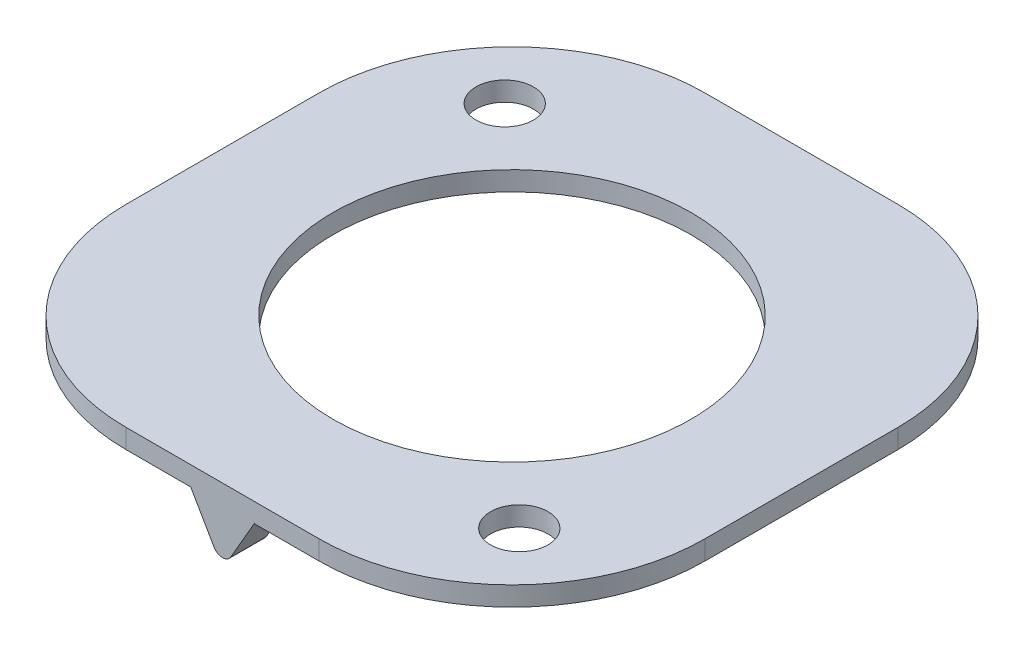
ISO-10303-21;
HEADER;
FILE_DESCRIPTION(('STEP AP214'),'2;1');
FILE_NAME('part.step','',(''),(''),'','','');
FILE_SCHEMA(('AUTOMOTIVE_DESIGN { 1 0 10303 214 1 1 1 1 }'));
ENDSEC;
DATA;
#1=APPLICATION_CONTEXT('core data for automotive mechanical design processes');
#2=APPLICATION_PROTOCOL_DEFINITION('international standard','automotive_design',2000,#1);
#3=PRODUCT_CONTEXT('',#1,'mechanical');
#4=PRODUCT('Part','Part','',(#3));
#5=PRODUCT_RELATED_PRODUCT_CATEGORY('part','',(#4));
#6=PRODUCT_DEFINITION_FORMATION('','',#4);
#7=PRODUCT_DEFINITION_CONTEXT('part definition',#1,'design');
#8=PRODUCT_DEFINITION('design','',#6,#7);
#9=PRODUCT_DEFINITION_SHAPE('','',#8);
#10=(LENGTH_UNIT() NAMED_UNIT(*) SI_UNIT(.MILLI.,.METRE.));
#11=(NAMED_UNIT(*) PLANE_ANGLE_UNIT() SI_UNIT($,.RADIAN.));
#12=(NAMED_UNIT(*) SI_UNIT($,.STERADIAN.) SOLID_ANGLE_UNIT());
#13=UNCERTAINTY_MEASURE_WITH_UNIT(LENGTH_MEASURE(1.E-05),#10,'distance_accuracy_value','');
#14=(GEOMETRIC_REPRESENTATION_CONTEXT(3) GLOBAL_UNCERTAINTY_ASSIGNED_CONTEXT((#13)) GLOBAL_UNIT_ASSIGNED_CONTEXT((#10,
#11,#12)) REPRESENTATION_CONTEXT('',''));
#15=CARTESIAN_POINT('',(0.,0.,0.));
#16=DIRECTION('',(0.,0.,1.));
#17=DIRECTION('',(1.,0.,0.));
#18=AXIS2_PLACEMENT_3D('',#15,#16,#17);
#19=CARTESIAN_POINT('',(-15.,19.,-15.01));
#20=DIRECTION('',(0.,-1.,0.));
#21=DIRECTION('',(0.,0.,-1.));
#22=AXIS2_PLACEMENT_3D('',#19,#20,#21);
#23=PLANE('',#22);
#24=CARTESIAN_POINT('',(0.,19.,0.));
#25=DIRECTION('',(0.,-1.,0.));
#26=DIRECTION('',(0.,0.,-1.));
#27=AXIS2_PLACEMENT_3D('',#24,#25,#26);
#28=CIRCLE('',#27,9.27774999999996);
#29=CARTESIAN_POINT('',(0.,19.,-9.27774999999995));
#30=VERTEX_POINT('',#29);
#31=EDGE_CURVE('E245',#30,#30,#28,.F.);
#32=ORIENTED_EDGE('',*,*,#31,.T.);
#33=EDGE_LOOP('',(#32));
#34=FACE_BOUND('',#33,.T.);
#35=CARTESIAN_POINT('',(9.71815906597584,19.,9.34105517720241));
#36=DIRECTION('',(0.,-1.,0.));
#37=DIRECTION('',(0.,0.,-1.));
#38=AXIS2_PLACEMENT_3D('',#35,#36,#37);
#39=CIRCLE('',#38,1.49);
#40=CARTESIAN_POINT('',(9.71815906597584,19.,7.85105517720241));
#41=VERTEX_POINT('',#40);
#42=EDGE_CURVE('E193',#41,#41,#39,.F.);
#43=ORIENTED_EDGE('',*,*,#42,.T.);
#44=EDGE_LOOP('',(#43));
#45=FACE_BOUND('',#44,.T.);
#46=CARTESIAN_POINT('',(-9.71815906597584,19.,-9.34105517720241));
#47=DIRECTION('',(0.,-1.,0.));
#48=DIRECTION('',(0.,0.,-1.));
#49=AXIS2_PLACEMENT_3D('',#46,#47,#48);
#50=CIRCLE('',#49,1.49);
#51=CARTESIAN_POINT('',(-9.71815906597584,19.,-10.8310551772024));
#52=VERTEX_POINT('',#51);
#53=EDGE_CURVE('E248',#52,#52,#50,.F.);
#54=ORIENTED_EDGE('',*,*,#53,.T.);
#55=EDGE_LOOP('',(#54));
#56=FACE_BOUND('',#55,.T.);
#57=DIRECTION('',(-1.,0.,0.));
#58=VECTOR('',#57,1.);
#59=CARTESIAN_POINT('',(15.,19.,15.));
#60=LINE('',#59,#58);
#61=CARTESIAN_POINT('',(5.,19.,15.));
#62=VERTEX_POINT('',#61);
#63=CARTESIAN_POINT('',(1.64544826719043,19.,15.));
#64=VERTEX_POINT('',#63);
#65=EDGE_CURVE('E165',#62,#64,#60,.T.);
#66=ORIENTED_EDGE('',*,*,#65,.T.);
#67=DIRECTION('',(0.,0.,-1.));
#68=VECTOR('',#67,1.);
#69=CARTESIAN_POINT('',(1.64544826719043,19.,-15.01));
#70=LINE('',#69,#68);
#71=CARTESIAN_POINT('',(1.64544826719044,19.,13.15));
#72=VERTEX_POINT('',#71);
#73=EDGE_CURVE('E171',#64,#72,#70,.T.);
#74=ORIENTED_EDGE('',*,*,#73,.T.);
#75=DIRECTION('',(-1.,0.,0.));
#76=VECTOR('',#75,1.);
#77=CARTESIAN_POINT('',(-15.,19.,13.15));
#78=LINE('',#77,#76);
#79=CARTESIAN_POINT('',(-1.64544826719043,19.,13.15));
#80=VERTEX_POINT('',#79);
#81=EDGE_CURVE('E170',#72,#80,#78,.T.);
#82=ORIENTED_EDGE('',*,*,#81,.T.);
#83=DIRECTION('',(0.,0.,1.));
#84=VECTOR('',#83,1.);
#85=CARTESIAN_POINT('',(-1.64544826719044,19.,-15.01));
#86=LINE('',#85,#84);
#87=CARTESIAN_POINT('',(-1.64544826719043,19.,15.));
#88=VERTEX_POINT('',#87);
#89=EDGE_CURVE('E150',#80,#88,#86,.T.);
#90=ORIENTED_EDGE('',*,*,#89,.T.);
#91=CARTESIAN_POINT('',(-5.,19.,15.));
#92=VERTEX_POINT('',#91);
#93=EDGE_CURVE('E158',#88,#92,#60,.T.);
#94=ORIENTED_EDGE('',*,*,#93,.T.);
#95=CARTESIAN_POINT('',(-5.,19.,5.00000000000001));
#96=DIRECTION('',(0.,-1.,0.));
#97=DIRECTION('',(0.,0.,-1.));
#98=AXIS2_PLACEMENT_3D('',#95,#96,#97);
#99=CIRCLE('',#98,10.);
#100=CARTESIAN_POINT('',(-15.,19.,5.00000000000001));
#101=VERTEX_POINT('',#100);
#102=EDGE_CURVE('E229',#101,#92,#99,.F.);
#103=ORIENTED_EDGE('',*,*,#102,.F.);
#104=DIRECTION('',(0.,0.,-1.));
#105=VECTOR('',#104,1.);
#106=CARTESIAN_POINT('',(-15.,19.,-15.));
#107=LINE('',#106,#105);
#108=CARTESIAN_POINT('',(-15.,19.,-4.99999999999999));
#109=VERTEX_POINT('',#108);
#110=EDGE_CURVE('E236',#101,#109,#107,.T.);
#111=ORIENTED_EDGE('',*,*,#110,.T.);
#112=CARTESIAN_POINT('',(-5.,19.,-4.99999999999999));
#113=DIRECTION('',(0.,-1.,0.));
#114=DIRECTION('',(0.,0.,-1.));
#115=AXIS2_PLACEMENT_3D('',#112,#113,#114);
#116=CIRCLE('',#115,10.);
#117=CARTESIAN_POINT('',(-5.,19.,-15.));
#118=VERTEX_POINT('',#117);
#119=EDGE_CURVE('E234',#118,#109,#116,.F.);
#120=ORIENTED_EDGE('',*,*,#119,.F.);
#121=DIRECTION('',(1.,0.,0.));
#122=VECTOR('',#121,1.);
#123=CARTESIAN_POINT('',(15.,19.,-15.));
#124=LINE('',#123,#122);
#125=CARTESIAN_POINT('',(-1.64544826719044,19.,-15.));
#126=VERTEX_POINT('',#125);
#127=EDGE_CURVE('E241',#118,#126,#124,.T.);
#128=ORIENTED_EDGE('',*,*,#127,.T.);
#129=DIRECTION('',(0.,0.,-1.));
#130=VECTOR('',#129,1.);
#131=CARTESIAN_POINT('',(-1.64544826719044,19.,-15.01));
#132=LINE('',#131,#130);
#133=CARTESIAN_POINT('',(-1.64544826719044,19.,-13.15));
#134=VERTEX_POINT('',#133);
#135=EDGE_CURVE('E185',#134,#126,#132,.T.);
#136=ORIENTED_EDGE('',*,*,#135,.F.);
#137=DIRECTION('',(1.,0.,0.));
#138=VECTOR('',#137,1.);
#139=CARTESIAN_POINT('',(-15.,19.,-13.15));
#140=LINE('',#139,#138);
#141=CARTESIAN_POINT('',(1.64544826719043,19.,-13.15));
#142=VERTEX_POINT('',#141);
#143=EDGE_CURVE('E226',#134,#142,#140,.T.);
#144=ORIENTED_EDGE('',*,*,#143,.T.);
#145=DIRECTION('',(0.,0.,1.));
#146=VECTOR('',#145,1.);
#147=CARTESIAN_POINT('',(1.64544826719043,19.,-15.01));
#148=LINE('',#147,#146);
#149=CARTESIAN_POINT('',(1.64544826719043,19.,-15.));
#150=VERTEX_POINT('',#149);
#151=EDGE_CURVE('E190',#150,#142,#148,.T.);
#152=ORIENTED_EDGE('',*,*,#151,.F.);
#153=CARTESIAN_POINT('',(4.99999999999999,19.,-15.));
#154=VERTEX_POINT('',#153);
#155=EDGE_CURVE('E244',#150,#154,#124,.T.);
#156=ORIENTED_EDGE('',*,*,#155,.T.);
#157=CARTESIAN_POINT('',(5.,19.,-4.99999999999999));
#158=DIRECTION('',(0.,-1.,0.));
#159=DIRECTION('',(0.,0.,-1.));
#160=AXIS2_PLACEMENT_3D('',#157,#158,#159);
#161=CIRCLE('',#160,10.);
#162=CARTESIAN_POINT('',(15.,19.,-4.99999999999999));
#163=VERTEX_POINT('',#162);
#164=EDGE_CURVE('E231',#163,#154,#161,.F.);
#165=ORIENTED_EDGE('',*,*,#164,.F.);
#166=DIRECTION('',(0.,0.,1.));
#167=VECTOR('',#166,1.);
#168=CARTESIAN_POINT('',(15.,19.,-15.));
#169=LINE('',#168,#167);
#170=CARTESIAN_POINT('',(15.,19.,5.));
#171=VERTEX_POINT('',#170);
#172=EDGE_CURVE('E166',#163,#171,#169,.T.);
#173=ORIENTED_EDGE('',*,*,#172,.T.);
#174=CARTESIAN_POINT('',(5.,19.,5.00000000000001));
#175=DIRECTION('',(0.,-1.,0.));
#176=DIRECTION('',(0.,0.,-1.));
#177=AXIS2_PLACEMENT_3D('',#174,#175,#176);
#178=CIRCLE('',#177,10.);
#179=EDGE_CURVE('E227',#62,#171,#178,.F.);
#180=ORIENTED_EDGE('',*,*,#179,.F.);
#181=EDGE_LOOP('',(#66,#74,#82,#90,#94,#103,#111,#120,#128,#136,#144,#152,#156,#165,#173,#180));
#182=FACE_BOUND('',#181,.T.);
#183=ADVANCED_FACE('F33',(#34,#45,#56,#182),#23,.T.);
#184=CARTESIAN_POINT('',(15.,20.,-15.));
#185=DIRECTION('',(0.,0.,1.));
#186=DIRECTION('',(1.,0.,0.));
#187=AXIS2_PLACEMENT_3D('',#184,#185,#186);
#188=PLANE('',#187);
#189=DIRECTION('',(-0.5,-0.866025403784439,0.));
#190=VECTOR('',#189,1.);
#191=CARTESIAN_POINT('',(1.86141732949224,19.3740693887697,-15.));
#192=LINE('',#191,#190);
#193=CARTESIAN_POINT('',(0.433012701892215,16.9,-15.));
#194=VERTEX_POINT('',#193);
#195=EDGE_CURVE('E174',#150,#194,#192,.T.);
#196=ORIENTED_EDGE('',*,*,#195,.T.);
#197=CARTESIAN_POINT('',(0.,17.15,-15.));
#198=DIRECTION('',(0.,0.,1.));
#199=DIRECTION('',(1.,0.,0.));
#200=AXIS2_PLACEMENT_3D('',#197,#198,#199);
#201=CIRCLE('',#200,0.5);
#202=CARTESIAN_POINT('',(-0.433012701892224,16.9,-15.));
#203=VERTEX_POINT('',#202);
#204=EDGE_CURVE('E55',#194,#203,#201,.F.);
#205=ORIENTED_EDGE('',*,*,#204,.T.);
#206=DIRECTION('',(-0.5,0.866025403784439,0.));
#207=VECTOR('',#206,1.);
#208=CARTESIAN_POINT('',(0.,16.15,-15.));
#209=LINE('',#208,#207);
#210=EDGE_CURVE('E183',#203,#126,#209,.T.);
#211=ORIENTED_EDGE('',*,*,#210,.T.);
#212=ORIENTED_EDGE('',*,*,#127,.F.);
#213=DIRECTION('',(0.,-1.,0.));
#214=VECTOR('',#213,1.);
#215=CARTESIAN_POINT('',(-5.,20.,-15.));
#216=LINE('',#215,#214);
#217=CARTESIAN_POINT('',(-5.,20.,-15.));
#218=VERTEX_POINT('',#217);
#219=EDGE_CURVE('E203',#118,#218,#216,.F.);
#220=ORIENTED_EDGE('',*,*,#219,.T.);
#221=DIRECTION('',(-1.,0.,0.));
#222=VECTOR('',#221,1.);
#223=CARTESIAN_POINT('',(15.,20.,-15.));
#224=LINE('',#223,#222);
#225=CARTESIAN_POINT('',(4.99999999999999,20.,-15.));
#226=VERTEX_POINT('',#225);
#227=EDGE_CURVE('E204',#226,#218,#224,.T.);
#228=ORIENTED_EDGE('',*,*,#227,.F.);
#229=DIRECTION('',(0.,-1.,0.));
#230=VECTOR('',#229,1.);
#231=CARTESIAN_POINT('',(4.99999999999999,20.,-15.));
#232=LINE('',#231,#230);
#233=EDGE_CURVE('E261',#226,#154,#232,.T.);
#234=ORIENTED_EDGE('',*,*,#233,.T.);
#235=ORIENTED_EDGE('',*,*,#155,.F.);
#236=EDGE_LOOP('',(#196,#205,#211,#212,#220,#228,#234,#235));
#237=FACE_BOUND('',#236,.T.);
#238=ADVANCED_FACE('F287',(#237),#188,.F.);
#239=CARTESIAN_POINT('',(0.,20.,0.));
#240=DIRECTION('',(0.,-1.,0.));
#241=DIRECTION('',(0.,0.,-1.));
#242=AXIS2_PLACEMENT_3D('',#239,#240,#241);
#243=PLANE('',#242);
#244=CARTESIAN_POINT('',(9.71815906597584,20.,9.34105517720241));
#245=DIRECTION('',(0.,1.,0.));
#246=DIRECTION('',(0.,0.,-1.));
#247=AXIS2_PLACEMENT_3D('',#244,#245,#246);
#248=CIRCLE('',#247,1.49);
#249=CARTESIAN_POINT('',(9.71815906597584,20.,7.85105517720241));
#250=VERTEX_POINT('',#249);
#251=EDGE_CURVE('E223',#250,#250,#248,.T.);
#252=ORIENTED_EDGE('',*,*,#251,.F.);
#253=EDGE_LOOP('',(#252));
#254=FACE_BOUND('',#253,.T.);
#255=CARTESIAN_POINT('',(-9.71815906597584,20.,-9.34105517720241));
#256=DIRECTION('',(0.,1.,0.));
#257=DIRECTION('',(0.,0.,1.));
#258=AXIS2_PLACEMENT_3D('',#255,#256,#257);
#259=CIRCLE('',#258,1.49);
#260=CARTESIAN_POINT('',(-9.71815906597584,20.,-7.85105517720241));
#261=VERTEX_POINT('',#260);
#262=EDGE_CURVE('E220',#261,#261,#259,.T.);
#263=ORIENTED_EDGE('',*,*,#262,.F.);
#264=EDGE_LOOP('',(#263));
#265=FACE_BOUND('',#264,.T.);
#266=CARTESIAN_POINT('',(0.,20.,0.));
#267=DIRECTION('',(0.,1.,0.));
#268=DIRECTION('',(0.,0.,1.));
#269=AXIS2_PLACEMENT_3D('',#266,#267,#268);
#270=CIRCLE('',#269,9.27774999999996);
#271=CARTESIAN_POINT('',(0.,20.,9.27774999999997));
#272=VERTEX_POINT('',#271);
#273=EDGE_CURVE('E217',#272,#272,#270,.T.);
#274=ORIENTED_EDGE('',*,*,#273,.F.);
#275=EDGE_LOOP('',(#274));
#276=FACE_BOUND('',#275,.T.);
#277=ORIENTED_EDGE('',*,*,#227,.T.);
#278=CARTESIAN_POINT('',(-5.,20.,-4.99999999999999));
#279=DIRECTION('',(0.,-1.,0.));
#280=DIRECTION('',(0.,0.,-1.));
#281=AXIS2_PLACEMENT_3D('',#278,#279,#280);
#282=CIRCLE('',#281,10.);
#283=CARTESIAN_POINT('',(-15.,20.,-4.99999999999999));
#284=VERTEX_POINT('',#283);
#285=EDGE_CURVE('E194',#218,#284,#282,.F.);
#286=ORIENTED_EDGE('',*,*,#285,.T.);
#287=DIRECTION('',(0.,0.,1.));
#288=VECTOR('',#287,1.);
#289=CARTESIAN_POINT('',(-15.,20.,-15.));
#290=LINE('',#289,#288);
#291=CARTESIAN_POINT('',(-15.,20.,5.00000000000001));
#292=VERTEX_POINT('',#291);
#293=EDGE_CURVE('E214',#284,#292,#290,.T.);
#294=ORIENTED_EDGE('',*,*,#293,.T.);
#295=CARTESIAN_POINT('',(-5.,20.,5.00000000000001));
#296=DIRECTION('',(0.,-1.,0.));
#297=DIRECTION('',(0.,0.,-1.));
#298=AXIS2_PLACEMENT_3D('',#295,#296,#297);
#299=CIRCLE('',#298,10.);
#300=CARTESIAN_POINT('',(-5.,20.,15.));
#301=VERTEX_POINT('',#300);
#302=EDGE_CURVE('E199',#292,#301,#299,.F.);
#303=ORIENTED_EDGE('',*,*,#302,.T.);
#304=DIRECTION('',(1.,0.,0.));
#305=VECTOR('',#304,1.);
#306=CARTESIAN_POINT('',(15.,20.,15.));
#307=LINE('',#306,#305);
#308=CARTESIAN_POINT('',(5.,20.,15.));
#309=VERTEX_POINT('',#308);
#310=EDGE_CURVE('E211',#301,#309,#307,.T.);
#311=ORIENTED_EDGE('',*,*,#310,.T.);
#312=CARTESIAN_POINT('',(5.,20.,5.00000000000001));
#313=DIRECTION('',(0.,-1.,0.));
#314=DIRECTION('',(0.,0.,-1.));
#315=AXIS2_PLACEMENT_3D('',#312,#313,#314);
#316=CIRCLE('',#315,10.);
#317=CARTESIAN_POINT('',(15.,20.,5.));
#318=VERTEX_POINT('',#317);
#319=EDGE_CURVE('E201',#309,#318,#316,.F.);
#320=ORIENTED_EDGE('',*,*,#319,.T.);
#321=DIRECTION('',(0.,0.,-1.));
#322=VECTOR('',#321,1.);
#323=CARTESIAN_POINT('',(15.,20.,-15.));
#324=LINE('',#323,#322);
#325=CARTESIAN_POINT('',(15.,20.,-4.99999999999999));
#326=VERTEX_POINT('',#325);
#327=EDGE_CURVE('E207',#318,#326,#324,.T.);
#328=ORIENTED_EDGE('',*,*,#327,.T.);
#329=CARTESIAN_POINT('',(5.,20.,-4.99999999999999));
#330=DIRECTION('',(0.,-1.,0.));
#331=DIRECTION('',(0.,0.,-1.));
#332=AXIS2_PLACEMENT_3D('',#329,#330,#331);
#333=CIRCLE('',#332,10.);
#334=EDGE_CURVE('E196',#326,#226,#333,.F.);
#335=ORIENTED_EDGE('',*,*,#334,.T.);
#336=EDGE_LOOP('',(#277,#286,#294,#303,#311,#320,#328,#335));
#337=FACE_BOUND('',#336,.T.);
#338=ADVANCED_FACE('F308',(#254,#265,#276,#337),#243,.F.);
#339=CARTESIAN_POINT('',(9.71815906597584,5.,9.34105517720241));
#340=DIRECTION('',(0.,1.,0.));
#341=DIRECTION('',(0.,0.,1.));
#342=AXIS2_PLACEMENT_3D('',#339,#340,#341);
#343=CYLINDRICAL_SURFACE('',#342,1.49);
#344=ORIENTED_EDGE('',*,*,#251,.T.);
#345=EDGE_LOOP('',(#344));
#346=FACE_BOUND('',#345,.T.);
#347=ORIENTED_EDGE('',*,*,#42,.F.);
#348=EDGE_LOOP('',(#347));
#349=FACE_BOUND('',#348,.T.);
#350=ADVANCED_FACE('F314',(#346,#349),#343,.F.);
#351=CARTESIAN_POINT('',(-9.71815906597584,5.,-9.34105517720241));
#352=DIRECTION('',(0.,1.,0.));
#353=DIRECTION('',(0.,0.,1.));
#354=AXIS2_PLACEMENT_3D('',#351,#352,#353);
#355=CYLINDRICAL_SURFACE('',#354,1.49);
#356=ORIENTED_EDGE('',*,*,#262,.T.);
#357=EDGE_LOOP('',(#356));
#358=FACE_BOUND('',#357,.T.);
#359=ORIENTED_EDGE('',*,*,#53,.F.);
#360=EDGE_LOOP('',(#359));
#361=FACE_BOUND('',#360,.T.);
#362=ADVANCED_FACE('F317',(#358,#361),#355,.F.);
#363=CARTESIAN_POINT('',(15.,20.,-15.));
#364=DIRECTION('',(-1.,0.,0.));
#365=DIRECTION('',(0.,0.,1.));
#366=AXIS2_PLACEMENT_3D('',#363,#364,#365);
#367=PLANE('',#366);
#368=ORIENTED_EDGE('',*,*,#172,.F.);
#369=DIRECTION('',(0.,-1.,0.));
#370=VECTOR('',#369,1.);
#371=CARTESIAN_POINT('',(15.,20.,-4.99999999999999));
#372=LINE('',#371,#370);
#373=EDGE_CURVE('E256',#163,#326,#372,.F.);
#374=ORIENTED_EDGE('',*,*,#373,.T.);
#375=ORIENTED_EDGE('',*,*,#327,.F.);
#376=DIRECTION('',(0.,-1.,0.));
#377=VECTOR('',#376,1.);
#378=CARTESIAN_POINT('',(15.,20.,5.));
#379=LINE('',#378,#377);
#380=EDGE_CURVE('E197',#318,#171,#379,.T.);
#381=ORIENTED_EDGE('',*,*,#380,.T.);
#382=EDGE_LOOP('',(#368,#374,#375,#381));
#383=FACE_BOUND('',#382,.T.);
#384=ADVANCED_FACE('F320',(#383),#367,.F.);
#385=CARTESIAN_POINT('',(15.,20.,15.));
#386=DIRECTION('',(0.,0.,-1.));
#387=DIRECTION('',(-1.,0.,0.));
#388=AXIS2_PLACEMENT_3D('',#385,#386,#387);
#389=PLANE('',#388);
#390=DIRECTION('',(-0.5,0.866025403784439,0.));
#391=VECTOR('',#390,1.);
#392=CARTESIAN_POINT('',(0.,16.15,15.));
#393=LINE('',#392,#391);
#394=CARTESIAN_POINT('',(-0.433012701892217,16.9,15.));
#395=VERTEX_POINT('',#394);
#396=EDGE_CURVE('E145',#395,#88,#393,.T.);
#397=ORIENTED_EDGE('',*,*,#396,.F.);
#398=CARTESIAN_POINT('',(0.,17.15,15.));
#399=DIRECTION('',(0.,0.,-1.));
#400=DIRECTION('',(-1.,0.,0.));
#401=AXIS2_PLACEMENT_3D('',#398,#399,#400);
#402=CIRCLE('',#401,0.5);
#403=CARTESIAN_POINT('',(0.433012701892222,16.9,15.));
#404=VERTEX_POINT('',#403);
#405=EDGE_CURVE('E271',#395,#404,#402,.F.);
#406=ORIENTED_EDGE('',*,*,#405,.T.);
#407=DIRECTION('',(-0.5,-0.866025403784439,0.));
#408=VECTOR('',#407,1.);
#409=CARTESIAN_POINT('',(1.86141732949224,19.3740693887697,15.));
#410=LINE('',#409,#408);
#411=EDGE_CURVE('E155',#64,#404,#410,.T.);
#412=ORIENTED_EDGE('',*,*,#411,.F.);
#413=ORIENTED_EDGE('',*,*,#65,.F.);
#414=DIRECTION('',(0.,-1.,0.));
#415=VECTOR('',#414,1.);
#416=CARTESIAN_POINT('',(5.,20.,15.));
#417=LINE('',#416,#415);
#418=EDGE_CURVE('E254',#62,#309,#417,.F.);
#419=ORIENTED_EDGE('',*,*,#418,.T.);
#420=ORIENTED_EDGE('',*,*,#310,.F.);
#421=DIRECTION('',(0.,-1.,0.));
#422=VECTOR('',#421,1.);
#423=CARTESIAN_POINT('',(-5.,20.,15.));
#424=LINE('',#423,#422);
#425=EDGE_CURVE('E162',#301,#92,#424,.T.);
#426=ORIENTED_EDGE('',*,*,#425,.T.);
#427=ORIENTED_EDGE('',*,*,#93,.F.);
#428=EDGE_LOOP('',(#397,#406,#412,#413,#419,#420,#426,#427));
#429=FACE_BOUND('',#428,.T.);
#430=ADVANCED_FACE('F159',(#429),#389,.F.);
#431=CARTESIAN_POINT('',(5.,20.,5.00000000000001));
#432=DIRECTION('',(0.,-1.,0.));
#433=DIRECTION('',(0.,0.,-1.));
#434=AXIS2_PLACEMENT_3D('',#431,#432,#433);
#435=CYLINDRICAL_SURFACE('',#434,10.);
#436=ORIENTED_EDGE('',*,*,#418,.F.);
#437=ORIENTED_EDGE('',*,*,#179,.T.);
#438=ORIENTED_EDGE('',*,*,#380,.F.);
#439=ORIENTED_EDGE('',*,*,#319,.F.);
#440=EDGE_LOOP('',(#436,#437,#438,#439));
#441=FACE_BOUND('',#440,.T.);
#442=ADVANCED_FACE('F328',(#441),#435,.T.);
#443=CARTESIAN_POINT('',(-15.,20.,-15.));
#444=DIRECTION('',(1.,0.,0.));
#445=DIRECTION('',(0.,0.,-1.));
#446=AXIS2_PLACEMENT_3D('',#443,#444,#445);
#447=PLANE('',#446);
#448=ORIENTED_EDGE('',*,*,#110,.F.);
#449=DIRECTION('',(0.,-1.,0.));
#450=VECTOR('',#449,1.);
#451=CARTESIAN_POINT('',(-15.,20.,5.00000000000001));
#452=LINE('',#451,#450);
#453=EDGE_CURVE('E208',#101,#292,#452,.F.);
#454=ORIENTED_EDGE('',*,*,#453,.T.);
#455=ORIENTED_EDGE('',*,*,#293,.F.);
#456=DIRECTION('',(0.,-1.,0.));
#457=VECTOR('',#456,1.);
#458=CARTESIAN_POINT('',(-15.,20.,-4.99999999999999));
#459=LINE('',#458,#457);
#460=EDGE_CURVE('E264',#284,#109,#459,.T.);
#461=ORIENTED_EDGE('',*,*,#460,.T.);
#462=EDGE_LOOP('',(#448,#454,#455,#461));
#463=FACE_BOUND('',#462,.T.);
#464=ADVANCED_FACE('F331',(#463),#447,.F.);
#465=CARTESIAN_POINT('',(-5.,20.,5.00000000000001));
#466=DIRECTION('',(0.,-1.,0.));
#467=DIRECTION('',(0.,0.,-1.));
#468=AXIS2_PLACEMENT_3D('',#465,#466,#467);
#469=CYLINDRICAL_SURFACE('',#468,10.);
#470=ORIENTED_EDGE('',*,*,#453,.F.);
#471=ORIENTED_EDGE('',*,*,#102,.T.);
#472=ORIENTED_EDGE('',*,*,#425,.F.);
#473=ORIENTED_EDGE('',*,*,#302,.F.);
#474=EDGE_LOOP('',(#470,#471,#472,#473));
#475=FACE_BOUND('',#474,.T.);
#476=ADVANCED_FACE('F335',(#475),#469,.T.);
#477=CARTESIAN_POINT('',(5.,20.,-4.99999999999999));
#478=DIRECTION('',(0.,-1.,0.));
#479=DIRECTION('',(0.,0.,-1.));
#480=AXIS2_PLACEMENT_3D('',#477,#478,#479);
#481=CYLINDRICAL_SURFACE('',#480,10.);
#482=ORIENTED_EDGE('',*,*,#373,.F.);
#483=ORIENTED_EDGE('',*,*,#164,.T.);
#484=ORIENTED_EDGE('',*,*,#233,.F.);
#485=ORIENTED_EDGE('',*,*,#334,.F.);
#486=EDGE_LOOP('',(#482,#483,#484,#485));
#487=FACE_BOUND('',#486,.T.);
#488=ADVANCED_FACE('F339',(#487),#481,.T.);
#489=CARTESIAN_POINT('',(-5.,20.,-4.99999999999999));
#490=DIRECTION('',(0.,-1.,0.));
#491=DIRECTION('',(0.,0.,-1.));
#492=AXIS2_PLACEMENT_3D('',#489,#490,#491);
#493=CYLINDRICAL_SURFACE('',#492,10.);
#494=ORIENTED_EDGE('',*,*,#219,.F.);
#495=ORIENTED_EDGE('',*,*,#119,.T.);
#496=ORIENTED_EDGE('',*,*,#460,.F.);
#497=ORIENTED_EDGE('',*,*,#285,.F.);
#498=EDGE_LOOP('',(#494,#495,#496,#497));
#499=FACE_BOUND('',#498,.T.);
#500=ADVANCED_FACE('F343',(#499),#493,.T.);
#501=CARTESIAN_POINT('',(0.,320.443462068965,0.));
#502=DIRECTION('',(0.,1.,0.));
#503=DIRECTION('',(0.,0.,1.));
#504=AXIS2_PLACEMENT_3D('',#501,#502,#503);
#505=CYLINDRICAL_SURFACE('',#504,9.27774999999996);
#506=ORIENTED_EDGE('',*,*,#273,.T.);
#507=EDGE_LOOP('',(#506));
#508=FACE_BOUND('',#507,.T.);
#509=ORIENTED_EDGE('',*,*,#31,.F.);
#510=EDGE_LOOP('',(#509));
#511=FACE_BOUND('',#510,.T.);
#512=ADVANCED_FACE('F347',(#508,#511),#505,.F.);
#513=CARTESIAN_POINT('',(1.86141732949224,19.3740693887697,-13.15));
#514=DIRECTION('',(0.866025403784439,-0.5,0.));
#515=DIRECTION('',(0.5,0.866025403784439,0.));
#516=AXIS2_PLACEMENT_3D('',#513,#514,#515);
#517=PLANE('',#516);
#518=DIRECTION('',(-0.5,-0.866025403784439,0.));
#519=VECTOR('',#518,1.);
#520=CARTESIAN_POINT('',(1.86141732949224,19.3740693887697,-13.15));
#521=LINE('',#520,#519);
#522=CARTESIAN_POINT('',(0.433012701892216,16.9,-13.15));
#523=VERTEX_POINT('',#522);
#524=EDGE_CURVE('E179',#142,#523,#521,.T.);
#525=ORIENTED_EDGE('',*,*,#524,.T.);
#526=DIRECTION('',(0.,0.,-1.));
#527=VECTOR('',#526,1.);
#528=CARTESIAN_POINT('',(0.433012701892215,16.9,-13.15));
#529=LINE('',#528,#527);
#530=EDGE_CURVE('E277',#523,#194,#529,.T.);
#531=ORIENTED_EDGE('',*,*,#530,.T.);
#532=ORIENTED_EDGE('',*,*,#195,.F.);
#533=ORIENTED_EDGE('',*,*,#151,.T.);
#534=EDGE_LOOP('',(#525,#531,#532,#533));
#535=FACE_BOUND('',#534,.T.);
#536=ADVANCED_FACE('F283',(#535),#517,.T.);
#537=CARTESIAN_POINT('',(0.,16.15,-13.15));
#538=DIRECTION('',(-0.866025403784439,-0.5,0.));
#539=DIRECTION('',(0.5,-0.866025403784439,0.));
#540=AXIS2_PLACEMENT_3D('',#537,#538,#539);
#541=PLANE('',#540);
#542=ORIENTED_EDGE('',*,*,#210,.F.);
#543=DIRECTION('',(0.,0.,-1.));
#544=VECTOR('',#543,1.);
#545=CARTESIAN_POINT('',(-0.433012701892224,16.9,-13.15));
#546=LINE('',#545,#544);
#547=CARTESIAN_POINT('',(-0.433012701892224,16.9,-13.15));
#548=VERTEX_POINT('',#547);
#549=EDGE_CURVE('E41',#203,#548,#546,.F.);
#550=ORIENTED_EDGE('',*,*,#549,.T.);
#551=DIRECTION('',(-0.5,0.866025403784439,0.));
#552=VECTOR('',#551,1.);
#553=CARTESIAN_POINT('',(0.,16.15,-13.15));
#554=LINE('',#553,#552);
#555=EDGE_CURVE('E182',#548,#134,#554,.T.);
#556=ORIENTED_EDGE('',*,*,#555,.T.);
#557=ORIENTED_EDGE('',*,*,#135,.T.);
#558=EDGE_LOOP('',(#542,#550,#556,#557));
#559=FACE_BOUND('',#558,.T.);
#560=ADVANCED_FACE('F354',(#559),#541,.T.);
#561=CARTESIAN_POINT('',(0.,0.,-13.15));
#562=DIRECTION('',(0.,0.,-1.));
#563=DIRECTION('',(-1.,0.,0.));
#564=AXIS2_PLACEMENT_3D('',#561,#562,#563);
#565=PLANE('',#564);
#566=ORIENTED_EDGE('',*,*,#555,.F.);
#567=CARTESIAN_POINT('',(0.,17.15,-13.15));
#568=DIRECTION('',(0.,0.,-1.));
#569=DIRECTION('',(-1.,0.,0.));
#570=AXIS2_PLACEMENT_3D('',#567,#568,#569);
#571=CIRCLE('',#570,0.5);
#572=EDGE_CURVE('E11',#548,#523,#571,.F.);
#573=ORIENTED_EDGE('',*,*,#572,.T.);
#574=ORIENTED_EDGE('',*,*,#524,.F.);
#575=ORIENTED_EDGE('',*,*,#143,.F.);
#576=EDGE_LOOP('',(#566,#573,#574,#575));
#577=FACE_BOUND('',#576,.T.);
#578=ADVANCED_FACE('F294',(#577),#565,.F.);
#579=CARTESIAN_POINT('',(1.86141732949224,19.3740693887697,13.15));
#580=DIRECTION('',(-0.866025403784439,0.5,0.));
#581=DIRECTION('',(-0.5,-0.866025403784439,0.));
#582=AXIS2_PLACEMENT_3D('',#579,#580,#581);
#583=PLANE('',#582);
#584=ORIENTED_EDGE('',*,*,#411,.T.);
#585=DIRECTION('',(0.,0.,1.));
#586=VECTOR('',#585,1.);
#587=CARTESIAN_POINT('',(0.433012701892222,16.9,13.15));
#588=LINE('',#587,#586);
#589=CARTESIAN_POINT('',(0.433012701892222,16.9,13.15));
#590=VERTEX_POINT('',#589);
#591=EDGE_CURVE('E273',#404,#590,#588,.F.);
#592=ORIENTED_EDGE('',*,*,#591,.T.);
#593=DIRECTION('',(-0.5,-0.866025403784439,0.));
#594=VECTOR('',#593,1.);
#595=CARTESIAN_POINT('',(1.86141732949224,19.3740693887697,13.15));
#596=LINE('',#595,#594);
#597=EDGE_CURVE('E154',#72,#590,#596,.T.);
#598=ORIENTED_EDGE('',*,*,#597,.F.);
#599=ORIENTED_EDGE('',*,*,#73,.F.);
#600=EDGE_LOOP('',(#584,#592,#598,#599));
#601=FACE_BOUND('',#600,.T.);
#602=ADVANCED_FACE('F376',(#601),#583,.F.);
#603=CARTESIAN_POINT('',(0.,16.15,13.15));
#604=DIRECTION('',(0.866025403784439,0.5,0.));
#605=DIRECTION('',(-0.5,0.866025403784439,0.));
#606=AXIS2_PLACEMENT_3D('',#603,#604,#605);
#607=PLANE('',#606);
#608=DIRECTION('',(-0.5,0.866025403784439,0.));
#609=VECTOR('',#608,1.);
#610=CARTESIAN_POINT('',(0.,16.15,13.15));
#611=LINE('',#610,#609);
#612=CARTESIAN_POINT('',(-0.433012701892218,16.9,13.15));
#613=VERTEX_POINT('',#612);
#614=EDGE_CURVE('E172',#613,#80,#611,.T.);
#615=ORIENTED_EDGE('',*,*,#614,.F.);
#616=DIRECTION('',(0.,0.,1.));
#617=VECTOR('',#616,1.);
#618=CARTESIAN_POINT('',(-0.433012701892218,16.9,13.15));
#619=LINE('',#618,#617);
#620=EDGE_CURVE('E152',#613,#395,#619,.T.);
#621=ORIENTED_EDGE('',*,*,#620,.T.);
#622=ORIENTED_EDGE('',*,*,#396,.T.);
#623=ORIENTED_EDGE('',*,*,#89,.F.);
#624=EDGE_LOOP('',(#615,#621,#622,#623));
#625=FACE_BOUND('',#624,.T.);
#626=ADVANCED_FACE('F148',(#625),#607,.F.);
#627=CARTESIAN_POINT('',(0.,0.,13.15));
#628=DIRECTION('',(0.,0.,1.));
#629=DIRECTION('',(-1.,0.,0.));
#630=AXIS2_PLACEMENT_3D('',#627,#628,#629);
#631=PLANE('',#630);
#632=ORIENTED_EDGE('',*,*,#597,.T.);
#633=CARTESIAN_POINT('',(0.,17.15,13.15));
#634=DIRECTION('',(0.,0.,1.));
#635=DIRECTION('',(1.,0.,0.));
#636=AXIS2_PLACEMENT_3D('',#633,#634,#635);
#637=CIRCLE('',#636,0.5);
#638=EDGE_CURVE('E275',#590,#613,#637,.F.);
#639=ORIENTED_EDGE('',*,*,#638,.T.);
#640=ORIENTED_EDGE('',*,*,#614,.T.);
#641=ORIENTED_EDGE('',*,*,#81,.F.);
#642=EDGE_LOOP('',(#632,#639,#640,#641));
#643=FACE_BOUND('',#642,.T.);
#644=ADVANCED_FACE('F300',(#643),#631,.F.);
#645=CARTESIAN_POINT('',(0.,17.15,13.15));
#646=DIRECTION('',(0.,0.,1.));
#647=DIRECTION('',(1.,0.,0.));
#648=AXIS2_PLACEMENT_3D('',#645,#646,#647);
#649=CYLINDRICAL_SURFACE('',#648,0.5);
#650=ORIENTED_EDGE('',*,*,#638,.F.);
#651=ORIENTED_EDGE('',*,*,#591,.F.);
#652=ORIENTED_EDGE('',*,*,#405,.F.);
#653=ORIENTED_EDGE('',*,*,#620,.F.);
#654=EDGE_LOOP('',(#650,#651,#652,#653));
#655=FACE_BOUND('',#654,.T.);
#656=ADVANCED_FACE('F296',(#655),#649,.T.);
#657=CARTESIAN_POINT('',(0.,17.15,-13.15));
#658=DIRECTION('',(0.,0.,-1.));
#659=DIRECTION('',(-1.,0.,0.));
#660=AXIS2_PLACEMENT_3D('',#657,#658,#659);
#661=CYLINDRICAL_SURFACE('',#660,0.5);
#662=ORIENTED_EDGE('',*,*,#572,.F.);
#663=ORIENTED_EDGE('',*,*,#549,.F.);
#664=ORIENTED_EDGE('',*,*,#204,.F.);
#665=ORIENTED_EDGE('',*,*,#530,.F.);
#666=EDGE_LOOP('',(#662,#663,#664,#665));
#667=FACE_BOUND('',#666,.T.);
#668=ADVANCED_FACE('F35',(#667),#661,.T.);
#669=CLOSED_SHELL('',(#183,#238,#338,#350,#362,#384,#430,#442,#464,#476,#488,#500,#512,#536,
#560,#578,#602,#626,#644,#656,#668));
#670=MANIFOLD_SOLID_BREP('B2',#669);
#671=ADVANCED_BREP_SHAPE_REPRESENTATION('',(#18,#670),#14);
#672=SHAPE_DEFINITION_REPRESENTATION(#9,#671);
ENDSEC;
END-ISO-10303-21;
